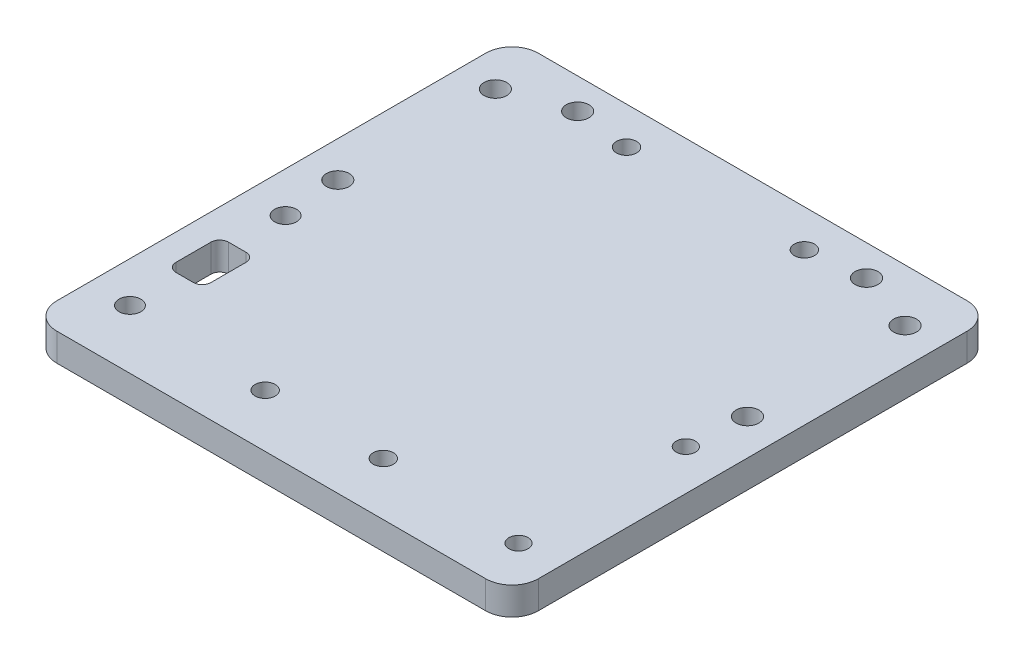
ISO-10303-21;
HEADER;
FILE_DESCRIPTION(('STEP AP214'),'2;1');
FILE_NAME('part.step','',(''),(''),'','','');
FILE_SCHEMA(('AUTOMOTIVE_DESIGN { 1 0 10303 214 1 1 1 1 }'));
ENDSEC;
DATA;
#1=APPLICATION_CONTEXT('core data for automotive mechanical design processes');
#2=APPLICATION_PROTOCOL_DEFINITION('international standard','automotive_design',2000,#1);
#3=PRODUCT_CONTEXT('',#1,'mechanical');
#4=PRODUCT('Part','Part','',(#3));
#5=PRODUCT_RELATED_PRODUCT_CATEGORY('part','',(#4));
#6=PRODUCT_DEFINITION_FORMATION('','',#4);
#7=PRODUCT_DEFINITION_CONTEXT('part definition',#1,'design');
#8=PRODUCT_DEFINITION('design','',#6,#7);
#9=PRODUCT_DEFINITION_SHAPE('','',#8);
#10=(LENGTH_UNIT() NAMED_UNIT(*) SI_UNIT(.MILLI.,.METRE.));
#11=(NAMED_UNIT(*) PLANE_ANGLE_UNIT() SI_UNIT($,.RADIAN.));
#12=(NAMED_UNIT(*) SI_UNIT($,.STERADIAN.) SOLID_ANGLE_UNIT());
#13=UNCERTAINTY_MEASURE_WITH_UNIT(LENGTH_MEASURE(1.E-05),#10,'distance_accuracy_value','');
#14=(GEOMETRIC_REPRESENTATION_CONTEXT(3) GLOBAL_UNCERTAINTY_ASSIGNED_CONTEXT((#13)) GLOBAL_UNIT_ASSIGNED_CONTEXT((#10,
#11,#12)) REPRESENTATION_CONTEXT('',''));
#15=CARTESIAN_POINT('',(0.,0.,0.));
#16=DIRECTION('',(0.,0.,1.));
#17=DIRECTION('',(1.,0.,0.));
#18=AXIS2_PLACEMENT_3D('',#15,#16,#17);
#19=CARTESIAN_POINT('',(27.5,3.175,-27.5));
#20=DIRECTION('',(-1.,0.,0.));
#21=DIRECTION('',(0.,0.,1.));
#22=AXIS2_PLACEMENT_3D('',#19,#20,#21);
#23=PLANE('',#22);
#24=DIRECTION('',(0.,0.,-1.));
#25=VECTOR('',#24,1.);
#26=CARTESIAN_POINT('',(27.5,3.175,-27.5));
#27=LINE('',#26,#25);
#28=CARTESIAN_POINT('',(27.5,3.175,24.5));
#29=VERTEX_POINT('',#28);
#30=CARTESIAN_POINT('',(27.5,3.175,-24.5));
#31=VERTEX_POINT('',#30);
#32=EDGE_CURVE('E283',#29,#31,#27,.T.);
#33=ORIENTED_EDGE('',*,*,#32,.F.);
#34=DIRECTION('',(0.,-1.,0.));
#35=VECTOR('',#34,1.);
#36=CARTESIAN_POINT('',(27.5,3.175,24.5));
#37=LINE('',#36,#35);
#38=CARTESIAN_POINT('',(27.5,0.,24.5));
#39=VERTEX_POINT('',#38);
#40=EDGE_CURVE('E334',#29,#39,#37,.T.);
#41=ORIENTED_EDGE('',*,*,#40,.T.);
#42=DIRECTION('',(0.,0.,-1.));
#43=VECTOR('',#42,1.);
#44=CARTESIAN_POINT('',(27.5,0.,-27.5));
#45=LINE('',#44,#43);
#46=CARTESIAN_POINT('',(27.5,0.,-24.5));
#47=VERTEX_POINT('',#46);
#48=EDGE_CURVE('E282',#39,#47,#45,.T.);
#49=ORIENTED_EDGE('',*,*,#48,.T.);
#50=DIRECTION('',(0.,-1.,0.));
#51=VECTOR('',#50,1.);
#52=CARTESIAN_POINT('',(27.5,3.175,-24.5));
#53=LINE('',#52,#51);
#54=EDGE_CURVE('E332',#47,#31,#53,.F.);
#55=ORIENTED_EDGE('',*,*,#54,.T.);
#56=EDGE_LOOP('',(#33,#41,#49,#55));
#57=FACE_BOUND('',#56,.T.);
#58=ADVANCED_FACE('F33',(#57),#23,.F.);
#59=CARTESIAN_POINT('',(-27.5,3.175,-27.5));
#60=DIRECTION('',(0.,0.,1.));
#61=DIRECTION('',(1.,0.,0.));
#62=AXIS2_PLACEMENT_3D('',#59,#60,#61);
#63=PLANE('',#62);
#64=DIRECTION('',(-1.,0.,0.));
#65=VECTOR('',#64,1.);
#66=CARTESIAN_POINT('',(-27.5,3.175,-27.5));
#67=LINE('',#66,#65);
#68=CARTESIAN_POINT('',(24.5,3.175,-27.5));
#69=VERTEX_POINT('',#68);
#70=CARTESIAN_POINT('',(-24.5,3.175,-27.5));
#71=VERTEX_POINT('',#70);
#72=EDGE_CURVE('E286',#69,#71,#67,.T.);
#73=ORIENTED_EDGE('',*,*,#72,.F.);
#74=DIRECTION('',(0.,-1.,0.));
#75=VECTOR('',#74,1.);
#76=CARTESIAN_POINT('',(24.5,3.175,-27.5));
#77=LINE('',#76,#75);
#78=CARTESIAN_POINT('',(24.5,0.,-27.5));
#79=VERTEX_POINT('',#78);
#80=EDGE_CURVE('E11',#69,#79,#77,.T.);
#81=ORIENTED_EDGE('',*,*,#80,.T.);
#82=DIRECTION('',(-1.,0.,0.));
#83=VECTOR('',#82,1.);
#84=CARTESIAN_POINT('',(-27.5,0.,-27.5));
#85=LINE('',#84,#83);
#86=CARTESIAN_POINT('',(-24.5,0.,-27.5));
#87=VERTEX_POINT('',#86);
#88=EDGE_CURVE('E299',#79,#87,#85,.T.);
#89=ORIENTED_EDGE('',*,*,#88,.T.);
#90=DIRECTION('',(0.,-1.,0.));
#91=VECTOR('',#90,1.);
#92=CARTESIAN_POINT('',(-24.5,3.175,-27.5));
#93=LINE('',#92,#91);
#94=EDGE_CURVE('E41',#87,#71,#93,.F.);
#95=ORIENTED_EDGE('',*,*,#94,.T.);
#96=EDGE_LOOP('',(#73,#81,#89,#95));
#97=FACE_BOUND('',#96,.T.);
#98=ADVANCED_FACE('F339',(#97),#63,.F.);
#99=CARTESIAN_POINT('',(-27.5,3.175,-27.5));
#100=DIRECTION('',(1.,0.,0.));
#101=DIRECTION('',(0.,0.,-1.));
#102=AXIS2_PLACEMENT_3D('',#99,#100,#101);
#103=PLANE('',#102);
#104=DIRECTION('',(0.,0.,1.));
#105=VECTOR('',#104,1.);
#106=CARTESIAN_POINT('',(-27.5,0.,-27.5));
#107=LINE('',#106,#105);
#108=CARTESIAN_POINT('',(-27.5,0.,-24.5));
#109=VERTEX_POINT('',#108);
#110=CARTESIAN_POINT('',(-27.5,0.,24.5));
#111=VERTEX_POINT('',#110);
#112=EDGE_CURVE('E302',#109,#111,#107,.T.);
#113=ORIENTED_EDGE('',*,*,#112,.T.);
#114=DIRECTION('',(0.,-1.,0.));
#115=VECTOR('',#114,1.);
#116=CARTESIAN_POINT('',(-27.5,3.175,24.5));
#117=LINE('',#116,#115);
#118=CARTESIAN_POINT('',(-27.5,3.175,24.5));
#119=VERTEX_POINT('',#118);
#120=EDGE_CURVE('E322',#111,#119,#117,.F.);
#121=ORIENTED_EDGE('',*,*,#120,.T.);
#122=DIRECTION('',(0.,0.,1.));
#123=VECTOR('',#122,1.);
#124=CARTESIAN_POINT('',(-27.5,3.175,-27.5));
#125=LINE('',#124,#123);
#126=CARTESIAN_POINT('',(-27.5,3.175,-24.5));
#127=VERTEX_POINT('',#126);
#128=EDGE_CURVE('E290',#127,#119,#125,.T.);
#129=ORIENTED_EDGE('',*,*,#128,.F.);
#130=DIRECTION('',(0.,-1.,0.));
#131=VECTOR('',#130,1.);
#132=CARTESIAN_POINT('',(-27.5,3.175,-24.5));
#133=LINE('',#132,#131);
#134=EDGE_CURVE('E319',#127,#109,#133,.T.);
#135=ORIENTED_EDGE('',*,*,#134,.T.);
#136=EDGE_LOOP('',(#113,#121,#129,#135));
#137=FACE_BOUND('',#136,.T.);
#138=ADVANCED_FACE('F350',(#137),#103,.F.);
#139=CARTESIAN_POINT('',(-27.5,3.175,27.5));
#140=DIRECTION('',(0.,0.,-1.));
#141=DIRECTION('',(-1.,0.,0.));
#142=AXIS2_PLACEMENT_3D('',#139,#140,#141);
#143=PLANE('',#142);
#144=DIRECTION('',(1.,0.,0.));
#145=VECTOR('',#144,1.);
#146=CARTESIAN_POINT('',(-27.5,3.175,27.5));
#147=LINE('',#146,#145);
#148=CARTESIAN_POINT('',(-24.5,3.175,27.5));
#149=VERTEX_POINT('',#148);
#150=CARTESIAN_POINT('',(24.5,3.175,27.5));
#151=VERTEX_POINT('',#150);
#152=EDGE_CURVE('E293',#149,#151,#147,.T.);
#153=ORIENTED_EDGE('',*,*,#152,.F.);
#154=DIRECTION('',(0.,-1.,0.));
#155=VECTOR('',#154,1.);
#156=CARTESIAN_POINT('',(-24.5,3.175,27.5));
#157=LINE('',#156,#155);
#158=CARTESIAN_POINT('',(-24.5,0.,27.5));
#159=VERTEX_POINT('',#158);
#160=EDGE_CURVE('E308',#149,#159,#157,.T.);
#161=ORIENTED_EDGE('',*,*,#160,.T.);
#162=DIRECTION('',(1.,0.,0.));
#163=VECTOR('',#162,1.);
#164=CARTESIAN_POINT('',(-27.5,0.,27.5));
#165=LINE('',#164,#163);
#166=CARTESIAN_POINT('',(24.5,0.,27.5));
#167=VERTEX_POINT('',#166);
#168=EDGE_CURVE('E287',#159,#167,#165,.T.);
#169=ORIENTED_EDGE('',*,*,#168,.T.);
#170=DIRECTION('',(0.,-1.,0.));
#171=VECTOR('',#170,1.);
#172=CARTESIAN_POINT('',(24.5,3.175,27.5));
#173=LINE('',#172,#171);
#174=EDGE_CURVE('E296',#167,#151,#173,.F.);
#175=ORIENTED_EDGE('',*,*,#174,.T.);
#176=EDGE_LOOP('',(#153,#161,#169,#175));
#177=FACE_BOUND('',#176,.T.);
#178=ADVANCED_FACE('F361',(#177),#143,.F.);
#179=CARTESIAN_POINT('',(0.,3.175,0.));
#180=DIRECTION('',(0.,1.,0.));
#181=DIRECTION('',(0.,0.,1.));
#182=AXIS2_PLACEMENT_3D('',#179,#180,#181);
#183=PLANE('',#182);
#184=CARTESIAN_POINT('',(-23.5,3.175,13.89));
#185=DIRECTION('',(0.,1.,0.));
#186=DIRECTION('',(0.,0.,1.));
#187=AXIS2_PLACEMENT_3D('',#184,#185,#186);
#188=CIRCLE('',#187,1.);
#189=CARTESIAN_POINT('',(-24.5,3.175,13.89));
#190=VERTEX_POINT('',#189);
#191=CARTESIAN_POINT('',(-23.5,3.175,14.89));
#192=VERTEX_POINT('',#191);
#193=EDGE_CURVE('E48',#190,#192,#188,.T.);
#194=ORIENTED_EDGE('',*,*,#193,.F.);
#195=DIRECTION('',(0.,0.,1.));
#196=VECTOR('',#195,1.);
#197=CARTESIAN_POINT('',(-24.5,3.175,9.89000000000001));
#198=LINE('',#197,#196);
#199=CARTESIAN_POINT('',(-24.5,3.175,9.89000000000001));
#200=VERTEX_POINT('',#199);
#201=EDGE_CURVE('E180',#200,#190,#198,.T.);
#202=ORIENTED_EDGE('',*,*,#201,.F.);
#203=CARTESIAN_POINT('',(-23.5,3.175,9.89));
#204=DIRECTION('',(0.,1.,0.));
#205=DIRECTION('',(0.,0.,1.));
#206=AXIS2_PLACEMENT_3D('',#203,#204,#205);
#207=CIRCLE('',#206,1.);
#208=CARTESIAN_POINT('',(-23.5,3.175,8.89));
#209=VERTEX_POINT('',#208);
#210=EDGE_CURVE('E177',#209,#200,#207,.T.);
#211=ORIENTED_EDGE('',*,*,#210,.F.);
#212=DIRECTION('',(-1.,0.,0.));
#213=VECTOR('',#212,1.);
#214=CARTESIAN_POINT('',(-23.5,3.175,8.89));
#215=LINE('',#214,#213);
#216=CARTESIAN_POINT('',(-21.5,3.175,8.89));
#217=VERTEX_POINT('',#216);
#218=EDGE_CURVE('E174',#217,#209,#215,.T.);
#219=ORIENTED_EDGE('',*,*,#218,.F.);
#220=CARTESIAN_POINT('',(-21.5,3.175,9.89));
#221=DIRECTION('',(0.,1.,0.));
#222=DIRECTION('',(0.,0.,-1.));
#223=AXIS2_PLACEMENT_3D('',#220,#221,#222);
#224=CIRCLE('',#223,1.);
#225=CARTESIAN_POINT('',(-20.5,3.175,9.89000000000001));
#226=VERTEX_POINT('',#225);
#227=EDGE_CURVE('E168',#226,#217,#224,.T.);
#228=ORIENTED_EDGE('',*,*,#227,.F.);
#229=DIRECTION('',(0.,0.,-1.));
#230=VECTOR('',#229,1.);
#231=CARTESIAN_POINT('',(-20.5,3.175,9.89000000000001));
#232=LINE('',#231,#230);
#233=CARTESIAN_POINT('',(-20.5,3.175,13.89));
#234=VERTEX_POINT('',#233);
#235=EDGE_CURVE('E166',#234,#226,#232,.T.);
#236=ORIENTED_EDGE('',*,*,#235,.F.);
#237=CARTESIAN_POINT('',(-21.5,3.175,13.89));
#238=DIRECTION('',(0.,1.,0.));
#239=DIRECTION('',(0.,0.,1.));
#240=AXIS2_PLACEMENT_3D('',#237,#238,#239);
#241=CIRCLE('',#240,1.);
#242=CARTESIAN_POINT('',(-21.5,3.175,14.89));
#243=VERTEX_POINT('',#242);
#244=EDGE_CURVE('E149',#243,#234,#241,.T.);
#245=ORIENTED_EDGE('',*,*,#244,.F.);
#246=DIRECTION('',(1.,0.,0.));
#247=VECTOR('',#246,1.);
#248=CARTESIAN_POINT('',(-23.5,3.175,14.89));
#249=LINE('',#248,#247);
#250=EDGE_CURVE('E158',#192,#243,#249,.T.);
#251=ORIENTED_EDGE('',*,*,#250,.F.);
#252=EDGE_LOOP('',(#194,#202,#211,#219,#228,#236,#245,#251));
#253=FACE_BOUND('',#252,.T.);
#254=CARTESIAN_POINT('',(-16.5,3.175,-24.));
#255=DIRECTION('',(0.,1.,0.));
#256=DIRECTION('',(0.,0.,1.));
#257=AXIS2_PLACEMENT_3D('',#254,#255,#256);
#258=CIRCLE('',#257,1.3);
#259=CARTESIAN_POINT('',(-16.5,3.175,-22.7));
#260=VERTEX_POINT('',#259);
#261=EDGE_CURVE('E199',#260,#260,#258,.T.);
#262=ORIENTED_EDGE('',*,*,#261,.F.);
#263=EDGE_LOOP('',(#262));
#264=FACE_BOUND('',#263,.T.);
#265=CARTESIAN_POINT('',(16.5,3.175,-24.));
#266=DIRECTION('',(0.,1.,0.));
#267=DIRECTION('',(0.,0.,-1.));
#268=AXIS2_PLACEMENT_3D('',#265,#266,#267);
#269=CIRCLE('',#268,1.3);
#270=CARTESIAN_POINT('',(16.5,3.175,-25.3));
#271=VERTEX_POINT('',#270);
#272=EDGE_CURVE('E197',#271,#271,#269,.T.);
#273=ORIENTED_EDGE('',*,*,#272,.F.);
#274=EDGE_LOOP('',(#273));
#275=FACE_BOUND('',#274,.T.);
#276=CARTESIAN_POINT('',(-6.74999999999999,3.175,21.45));
#277=DIRECTION('',(0.,1.,0.));
#278=DIRECTION('',(0.,0.,1.));
#279=AXIS2_PLACEMENT_3D('',#276,#277,#278);
#280=CIRCLE('',#279,1.15);
#281=CARTESIAN_POINT('',(-6.74999999999999,3.175,22.6));
#282=VERTEX_POINT('',#281);
#283=EDGE_CURVE('E211',#282,#282,#280,.T.);
#284=ORIENTED_EDGE('',*,*,#283,.F.);
#285=EDGE_LOOP('',(#284));
#286=FACE_BOUND('',#285,.T.);
#287=CARTESIAN_POINT('',(6.75,3.175,21.45));
#288=DIRECTION('',(0.,1.,0.));
#289=DIRECTION('',(0.,0.,-1.));
#290=AXIS2_PLACEMENT_3D('',#287,#288,#289);
#291=CIRCLE('',#290,1.15);
#292=CARTESIAN_POINT('',(6.75,3.175,20.3));
#293=VERTEX_POINT('',#292);
#294=EDGE_CURVE('E206',#293,#293,#291,.T.);
#295=ORIENTED_EDGE('',*,*,#294,.F.);
#296=EDGE_LOOP('',(#295));
#297=FACE_BOUND('',#296,.T.);
#298=CARTESIAN_POINT('',(-10.16,3.175,-23.24));
#299=DIRECTION('',(0.,1.,0.));
#300=DIRECTION('',(0.,0.,1.));
#301=AXIS2_PLACEMENT_3D('',#298,#299,#300);
#302=CIRCLE('',#301,1.15);
#303=CARTESIAN_POINT('',(-10.16,3.175,-22.09));
#304=VERTEX_POINT('',#303);
#305=EDGE_CURVE('E223',#304,#304,#302,.T.);
#306=ORIENTED_EDGE('',*,*,#305,.F.);
#307=EDGE_LOOP('',(#306));
#308=FACE_BOUND('',#307,.T.);
#309=CARTESIAN_POINT('',(10.16,3.175,-23.24));
#310=DIRECTION('',(0.,1.,0.));
#311=DIRECTION('',(0.,0.,1.));
#312=AXIS2_PLACEMENT_3D('',#309,#310,#311);
#313=CIRCLE('',#312,1.15);
#314=CARTESIAN_POINT('',(10.16,3.175,-22.09));
#315=VERTEX_POINT('',#314);
#316=EDGE_CURVE('E218',#315,#315,#313,.T.);
#317=ORIENTED_EDGE('',*,*,#316,.F.);
#318=EDGE_LOOP('',(#317));
#319=FACE_BOUND('',#318,.T.);
#320=CARTESIAN_POINT('',(-22.865,3.175,20.78));
#321=DIRECTION('',(0.,1.,0.));
#322=DIRECTION('',(0.,0.,1.));
#323=AXIS2_PLACEMENT_3D('',#320,#321,#322);
#324=CIRCLE('',#323,1.25);
#325=CARTESIAN_POINT('',(-22.865,3.175,22.03));
#326=VERTEX_POINT('',#325);
#327=EDGE_CURVE('E230',#326,#326,#324,.T.);
#328=ORIENTED_EDGE('',*,*,#327,.F.);
#329=EDGE_LOOP('',(#328));
#330=FACE_BOUND('',#329,.T.);
#331=CARTESIAN_POINT('',(22.855,3.175,22.11));
#332=DIRECTION('',(0.,1.,0.));
#333=DIRECTION('',(0.,0.,1.));
#334=AXIS2_PLACEMENT_3D('',#331,#332,#333);
#335=CIRCLE('',#334,1.1);
#336=CARTESIAN_POINT('',(22.855,3.175,23.21));
#337=VERTEX_POINT('',#336);
#338=EDGE_CURVE('E243',#337,#337,#335,.T.);
#339=ORIENTED_EDGE('',*,*,#338,.F.);
#340=EDGE_LOOP('',(#339));
#341=FACE_BOUND('',#340,.T.);
#342=CARTESIAN_POINT('',(22.855,3.175,3.));
#343=DIRECTION('',(0.,1.,0.));
#344=DIRECTION('',(0.,0.,1.));
#345=AXIS2_PLACEMENT_3D('',#342,#343,#344);
#346=CIRCLE('',#345,1.1);
#347=CARTESIAN_POINT('',(22.855,3.175,4.1));
#348=VERTEX_POINT('',#347);
#349=EDGE_CURVE('E235',#348,#348,#346,.T.);
#350=ORIENTED_EDGE('',*,*,#349,.F.);
#351=EDGE_LOOP('',(#350));
#352=FACE_BOUND('',#351,.T.);
#353=CARTESIAN_POINT('',(-22.865,3.175,3.));
#354=DIRECTION('',(0.,1.,0.));
#355=DIRECTION('',(0.,0.,1.));
#356=AXIS2_PLACEMENT_3D('',#353,#354,#355);
#357=CIRCLE('',#356,1.25);
#358=CARTESIAN_POINT('',(-22.865,3.175,4.25));
#359=VERTEX_POINT('',#358);
#360=EDGE_CURVE('E242',#359,#359,#357,.T.);
#361=ORIENTED_EDGE('',*,*,#360,.F.);
#362=EDGE_LOOP('',(#361));
#363=FACE_BOUND('',#362,.T.);
#364=CARTESIAN_POINT('',(23.4,3.175,-21.5));
#365=DIRECTION('',(0.,1.,0.));
#366=DIRECTION('',(0.,0.,-1.));
#367=AXIS2_PLACEMENT_3D('',#364,#365,#366);
#368=CIRCLE('',#367,1.29999999999999);
#369=CARTESIAN_POINT('',(23.4,3.175,-22.8));
#370=VERTEX_POINT('',#369);
#371=EDGE_CURVE('E258',#370,#370,#368,.T.);
#372=ORIENTED_EDGE('',*,*,#371,.F.);
#373=EDGE_LOOP('',(#372));
#374=FACE_BOUND('',#373,.T.);
#375=CARTESIAN_POINT('',(23.4,3.175,-3.5));
#376=DIRECTION('',(0.,1.,0.));
#377=DIRECTION('',(0.,0.,-1.));
#378=AXIS2_PLACEMENT_3D('',#375,#376,#377);
#379=CIRCLE('',#378,1.29999999999999);
#380=CARTESIAN_POINT('',(23.4,3.175,-4.8));
#381=VERTEX_POINT('',#380);
#382=EDGE_CURVE('E267',#381,#381,#379,.T.);
#383=ORIENTED_EDGE('',*,*,#382,.F.);
#384=EDGE_LOOP('',(#383));
#385=FACE_BOUND('',#384,.T.);
#386=CARTESIAN_POINT('',(-23.4,3.175,-3.5));
#387=DIRECTION('',(0.,1.,0.));
#388=DIRECTION('',(0.,0.,1.));
#389=AXIS2_PLACEMENT_3D('',#386,#387,#388);
#390=CIRCLE('',#389,1.29999999999999);
#391=CARTESIAN_POINT('',(-23.4,3.175,-2.2));
#392=VERTEX_POINT('',#391);
#393=EDGE_CURVE('E259',#392,#392,#390,.T.);
#394=ORIENTED_EDGE('',*,*,#393,.F.);
#395=EDGE_LOOP('',(#394));
#396=FACE_BOUND('',#395,.T.);
#397=CARTESIAN_POINT('',(-23.4,3.175,-21.5));
#398=DIRECTION('',(0.,1.,0.));
#399=DIRECTION('',(0.,0.,1.));
#400=AXIS2_PLACEMENT_3D('',#397,#398,#399);
#401=CIRCLE('',#400,1.29999999999999);
#402=CARTESIAN_POINT('',(-23.4,3.175,-20.2));
#403=VERTEX_POINT('',#402);
#404=EDGE_CURVE('E266',#403,#403,#401,.T.);
#405=ORIENTED_EDGE('',*,*,#404,.F.);
#406=EDGE_LOOP('',(#405));
#407=FACE_BOUND('',#406,.T.);
#408=ORIENTED_EDGE('',*,*,#128,.T.);
#409=CARTESIAN_POINT('',(-24.5,3.175,24.5));
#410=DIRECTION('',(0.,1.,0.));
#411=DIRECTION('',(0.,0.,1.));
#412=AXIS2_PLACEMENT_3D('',#409,#410,#411);
#413=CIRCLE('',#412,3.);
#414=EDGE_CURVE('E330',#119,#149,#413,.T.);
#415=ORIENTED_EDGE('',*,*,#414,.T.);
#416=ORIENTED_EDGE('',*,*,#152,.T.);
#417=CARTESIAN_POINT('',(24.5,3.175,24.5));
#418=DIRECTION('',(0.,1.,0.));
#419=DIRECTION('',(0.,0.,1.));
#420=AXIS2_PLACEMENT_3D('',#417,#418,#419);
#421=CIRCLE('',#420,3.);
#422=EDGE_CURVE('E328',#151,#29,#421,.T.);
#423=ORIENTED_EDGE('',*,*,#422,.T.);
#424=ORIENTED_EDGE('',*,*,#32,.T.);
#425=CARTESIAN_POINT('',(24.5,3.175,-24.5));
#426=DIRECTION('',(0.,1.,0.));
#427=DIRECTION('',(0.,0.,1.));
#428=AXIS2_PLACEMENT_3D('',#425,#426,#427);
#429=CIRCLE('',#428,3.);
#430=EDGE_CURVE('E326',#31,#69,#429,.T.);
#431=ORIENTED_EDGE('',*,*,#430,.T.);
#432=ORIENTED_EDGE('',*,*,#72,.T.);
#433=CARTESIAN_POINT('',(-24.5,3.175,-24.5));
#434=DIRECTION('',(0.,1.,0.));
#435=DIRECTION('',(0.,0.,1.));
#436=AXIS2_PLACEMENT_3D('',#433,#434,#435);
#437=CIRCLE('',#436,3.);
#438=EDGE_CURVE('E324',#71,#127,#437,.T.);
#439=ORIENTED_EDGE('',*,*,#438,.T.);
#440=EDGE_LOOP('',(#408,#415,#416,#423,#424,#431,#432,#439));
#441=FACE_BOUND('',#440,.T.);
#442=ADVANCED_FACE('F162',(#253,#264,#275,#286,#297,#308,#319,#330,#341,#352,#363,#374,#385,
#396,#407,#441),#183,.T.);
#443=CARTESIAN_POINT('',(0.,0.,0.));
#444=DIRECTION('',(0.,1.,0.));
#445=DIRECTION('',(0.,0.,1.));
#446=AXIS2_PLACEMENT_3D('',#443,#444,#445);
#447=PLANE('',#446);
#448=DIRECTION('',(0.,0.,-1.));
#449=VECTOR('',#448,1.);
#450=CARTESIAN_POINT('',(-24.5,0.,9.89000000000001));
#451=LINE('',#450,#449);
#452=CARTESIAN_POINT('',(-24.5,0.,13.89));
#453=VERTEX_POINT('',#452);
#454=CARTESIAN_POINT('',(-24.5,0.,9.89000000000001));
#455=VERTEX_POINT('',#454);
#456=EDGE_CURVE('E679',#453,#455,#451,.T.);
#457=ORIENTED_EDGE('',*,*,#456,.F.);
#458=CARTESIAN_POINT('',(-23.5,0.,13.89));
#459=DIRECTION('',(0.,1.,0.));
#460=DIRECTION('',(0.,0.,1.));
#461=AXIS2_PLACEMENT_3D('',#458,#459,#460);
#462=CIRCLE('',#461,1.);
#463=CARTESIAN_POINT('',(-23.5,0.,14.89));
#464=VERTEX_POINT('',#463);
#465=EDGE_CURVE('E198',#464,#453,#462,.F.);
#466=ORIENTED_EDGE('',*,*,#465,.F.);
#467=DIRECTION('',(-1.,0.,0.));
#468=VECTOR('',#467,1.);
#469=CARTESIAN_POINT('',(-23.5,0.,14.89));
#470=LINE('',#469,#468);
#471=CARTESIAN_POINT('',(-21.5,0.,14.89));
#472=VERTEX_POINT('',#471);
#473=EDGE_CURVE('E195',#472,#464,#470,.T.);
#474=ORIENTED_EDGE('',*,*,#473,.F.);
#475=CARTESIAN_POINT('',(-21.5,0.,13.89));
#476=DIRECTION('',(0.,1.,0.));
#477=DIRECTION('',(0.,0.,1.));
#478=AXIS2_PLACEMENT_3D('',#475,#476,#477);
#479=CIRCLE('',#478,1.);
#480=CARTESIAN_POINT('',(-20.5,0.,13.89));
#481=VERTEX_POINT('',#480);
#482=EDGE_CURVE('E152',#481,#472,#479,.F.);
#483=ORIENTED_EDGE('',*,*,#482,.F.);
#484=DIRECTION('',(0.,0.,1.));
#485=VECTOR('',#484,1.);
#486=CARTESIAN_POINT('',(-20.5,0.,9.89000000000001));
#487=LINE('',#486,#485);
#488=CARTESIAN_POINT('',(-20.5,0.,9.89000000000001));
#489=VERTEX_POINT('',#488);
#490=EDGE_CURVE('E665',#489,#481,#487,.T.);
#491=ORIENTED_EDGE('',*,*,#490,.F.);
#492=CARTESIAN_POINT('',(-21.5,0.,9.89));
#493=DIRECTION('',(0.,1.,0.));
#494=DIRECTION('',(0.,0.,1.));
#495=AXIS2_PLACEMENT_3D('',#492,#493,#494);
#496=CIRCLE('',#495,1.);
#497=CARTESIAN_POINT('',(-21.5,0.,8.89));
#498=VERTEX_POINT('',#497);
#499=EDGE_CURVE('E667',#498,#489,#496,.F.);
#500=ORIENTED_EDGE('',*,*,#499,.F.);
#501=DIRECTION('',(1.,0.,0.));
#502=VECTOR('',#501,1.);
#503=CARTESIAN_POINT('',(-23.5,0.,8.89));
#504=LINE('',#503,#502);
#505=CARTESIAN_POINT('',(-23.5,0.,8.89));
#506=VERTEX_POINT('',#505);
#507=EDGE_CURVE('E675',#506,#498,#504,.T.);
#508=ORIENTED_EDGE('',*,*,#507,.F.);
#509=CARTESIAN_POINT('',(-23.5,0.,9.89));
#510=DIRECTION('',(0.,1.,0.));
#511=DIRECTION('',(0.,0.,1.));
#512=AXIS2_PLACEMENT_3D('',#509,#510,#511);
#513=CIRCLE('',#512,1.);
#514=EDGE_CURVE('E677',#455,#506,#513,.F.);
#515=ORIENTED_EDGE('',*,*,#514,.F.);
#516=EDGE_LOOP('',(#457,#466,#474,#483,#491,#500,#508,#515));
#517=FACE_BOUND('',#516,.T.);
#518=CARTESIAN_POINT('',(-16.5,0.,-24.));
#519=DIRECTION('',(0.,1.,0.));
#520=DIRECTION('',(0.,0.,1.));
#521=AXIS2_PLACEMENT_3D('',#518,#519,#520);
#522=CIRCLE('',#521,1.3);
#523=CARTESIAN_POINT('',(-16.5,0.,-22.7));
#524=VERTEX_POINT('',#523);
#525=EDGE_CURVE('E202',#524,#524,#522,.F.);
#526=ORIENTED_EDGE('',*,*,#525,.F.);
#527=EDGE_LOOP('',(#526));
#528=FACE_BOUND('',#527,.T.);
#529=CARTESIAN_POINT('',(16.5,0.,-24.));
#530=DIRECTION('',(0.,1.,0.));
#531=DIRECTION('',(0.,0.,1.));
#532=AXIS2_PLACEMENT_3D('',#529,#530,#531);
#533=CIRCLE('',#532,1.3);
#534=CARTESIAN_POINT('',(16.5,0.,-22.7));
#535=VERTEX_POINT('',#534);
#536=EDGE_CURVE('E203',#535,#535,#533,.F.);
#537=ORIENTED_EDGE('',*,*,#536,.F.);
#538=EDGE_LOOP('',(#537));
#539=FACE_BOUND('',#538,.T.);
#540=CARTESIAN_POINT('',(-6.74999999999999,0.,21.45));
#541=DIRECTION('',(0.,1.,0.));
#542=DIRECTION('',(0.,0.,1.));
#543=AXIS2_PLACEMENT_3D('',#540,#541,#542);
#544=CIRCLE('',#543,1.15);
#545=CARTESIAN_POINT('',(-6.74999999999999,0.,22.6));
#546=VERTEX_POINT('',#545);
#547=EDGE_CURVE('E214',#546,#546,#544,.F.);
#548=ORIENTED_EDGE('',*,*,#547,.F.);
#549=EDGE_LOOP('',(#548));
#550=FACE_BOUND('',#549,.T.);
#551=CARTESIAN_POINT('',(6.75,0.,21.45));
#552=DIRECTION('',(0.,1.,0.));
#553=DIRECTION('',(0.,0.,1.));
#554=AXIS2_PLACEMENT_3D('',#551,#552,#553);
#555=CIRCLE('',#554,1.15);
#556=CARTESIAN_POINT('',(6.75,0.,22.6));
#557=VERTEX_POINT('',#556);
#558=EDGE_CURVE('E215',#557,#557,#555,.F.);
#559=ORIENTED_EDGE('',*,*,#558,.F.);
#560=EDGE_LOOP('',(#559));
#561=FACE_BOUND('',#560,.T.);
#562=CARTESIAN_POINT('',(-10.16,0.,-23.24));
#563=DIRECTION('',(0.,1.,0.));
#564=DIRECTION('',(0.,0.,1.));
#565=AXIS2_PLACEMENT_3D('',#562,#563,#564);
#566=CIRCLE('',#565,1.15);
#567=CARTESIAN_POINT('',(-10.16,0.,-22.09));
#568=VERTEX_POINT('',#567);
#569=EDGE_CURVE('E226',#568,#568,#566,.F.);
#570=ORIENTED_EDGE('',*,*,#569,.F.);
#571=EDGE_LOOP('',(#570));
#572=FACE_BOUND('',#571,.T.);
#573=CARTESIAN_POINT('',(10.16,0.,-23.24));
#574=DIRECTION('',(0.,1.,0.));
#575=DIRECTION('',(0.,0.,1.));
#576=AXIS2_PLACEMENT_3D('',#573,#574,#575);
#577=CIRCLE('',#576,1.15);
#578=CARTESIAN_POINT('',(10.16,0.,-22.09));
#579=VERTEX_POINT('',#578);
#580=EDGE_CURVE('E227',#579,#579,#577,.F.);
#581=ORIENTED_EDGE('',*,*,#580,.F.);
#582=EDGE_LOOP('',(#581));
#583=FACE_BOUND('',#582,.T.);
#584=CARTESIAN_POINT('',(-22.865,0.,20.78));
#585=DIRECTION('',(0.,1.,0.));
#586=DIRECTION('',(0.,0.,1.));
#587=AXIS2_PLACEMENT_3D('',#584,#585,#586);
#588=CIRCLE('',#587,1.25);
#589=CARTESIAN_POINT('',(-22.865,0.,22.03));
#590=VERTEX_POINT('',#589);
#591=EDGE_CURVE('E246',#590,#590,#588,.F.);
#592=ORIENTED_EDGE('',*,*,#591,.F.);
#593=EDGE_LOOP('',(#592));
#594=FACE_BOUND('',#593,.T.);
#595=CARTESIAN_POINT('',(22.855,0.,22.11));
#596=DIRECTION('',(0.,1.,0.));
#597=DIRECTION('',(0.,0.,1.));
#598=AXIS2_PLACEMENT_3D('',#595,#596,#597);
#599=CIRCLE('',#598,1.1);
#600=CARTESIAN_POINT('',(22.855,0.,23.21));
#601=VERTEX_POINT('',#600);
#602=EDGE_CURVE('E239',#601,#601,#599,.F.);
#603=ORIENTED_EDGE('',*,*,#602,.F.);
#604=EDGE_LOOP('',(#603));
#605=FACE_BOUND('',#604,.T.);
#606=CARTESIAN_POINT('',(22.855,0.,3.));
#607=DIRECTION('',(0.,1.,0.));
#608=DIRECTION('',(0.,0.,1.));
#609=AXIS2_PLACEMENT_3D('',#606,#607,#608);
#610=CIRCLE('',#609,1.1);
#611=CARTESIAN_POINT('',(22.855,0.,4.1));
#612=VERTEX_POINT('',#611);
#613=EDGE_CURVE('E238',#612,#612,#610,.F.);
#614=ORIENTED_EDGE('',*,*,#613,.F.);
#615=EDGE_LOOP('',(#614));
#616=FACE_BOUND('',#615,.T.);
#617=CARTESIAN_POINT('',(-22.865,0.,3.));
#618=DIRECTION('',(0.,1.,0.));
#619=DIRECTION('',(0.,0.,1.));
#620=AXIS2_PLACEMENT_3D('',#617,#618,#619);
#621=CIRCLE('',#620,1.25);
#622=CARTESIAN_POINT('',(-22.865,0.,4.25));
#623=VERTEX_POINT('',#622);
#624=EDGE_CURVE('E255',#623,#623,#621,.F.);
#625=ORIENTED_EDGE('',*,*,#624,.F.);
#626=EDGE_LOOP('',(#625));
#627=FACE_BOUND('',#626,.T.);
#628=CARTESIAN_POINT('',(23.4,0.,-21.5));
#629=DIRECTION('',(0.,1.,0.));
#630=DIRECTION('',(0.,0.,1.));
#631=AXIS2_PLACEMENT_3D('',#628,#629,#630);
#632=CIRCLE('',#631,1.29999999999999);
#633=CARTESIAN_POINT('',(23.4,0.,-20.2));
#634=VERTEX_POINT('',#633);
#635=EDGE_CURVE('E270',#634,#634,#632,.F.);
#636=ORIENTED_EDGE('',*,*,#635,.F.);
#637=EDGE_LOOP('',(#636));
#638=FACE_BOUND('',#637,.T.);
#639=CARTESIAN_POINT('',(23.4,0.,-3.5));
#640=DIRECTION('',(0.,1.,0.));
#641=DIRECTION('',(0.,0.,1.));
#642=AXIS2_PLACEMENT_3D('',#639,#640,#641);
#643=CIRCLE('',#642,1.29999999999999);
#644=CARTESIAN_POINT('',(23.4,0.,-2.20000000000001));
#645=VERTEX_POINT('',#644);
#646=EDGE_CURVE('E263',#645,#645,#643,.F.);
#647=ORIENTED_EDGE('',*,*,#646,.F.);
#648=EDGE_LOOP('',(#647));
#649=FACE_BOUND('',#648,.T.);
#650=CARTESIAN_POINT('',(-23.4,0.,-3.5));
#651=DIRECTION('',(0.,1.,0.));
#652=DIRECTION('',(0.,0.,1.));
#653=AXIS2_PLACEMENT_3D('',#650,#651,#652);
#654=CIRCLE('',#653,1.29999999999999);
#655=CARTESIAN_POINT('',(-23.4,0.,-2.2));
#656=VERTEX_POINT('',#655);
#657=EDGE_CURVE('E262',#656,#656,#654,.F.);
#658=ORIENTED_EDGE('',*,*,#657,.F.);
#659=EDGE_LOOP('',(#658));
#660=FACE_BOUND('',#659,.T.);
#661=CARTESIAN_POINT('',(-23.4,0.,-21.5));
#662=DIRECTION('',(0.,1.,0.));
#663=DIRECTION('',(0.,0.,1.));
#664=AXIS2_PLACEMENT_3D('',#661,#662,#663);
#665=CIRCLE('',#664,1.29999999999999);
#666=CARTESIAN_POINT('',(-23.4,0.,-20.2));
#667=VERTEX_POINT('',#666);
#668=EDGE_CURVE('E279',#667,#667,#665,.F.);
#669=ORIENTED_EDGE('',*,*,#668,.F.);
#670=EDGE_LOOP('',(#669));
#671=FACE_BOUND('',#670,.T.);
#672=ORIENTED_EDGE('',*,*,#168,.F.);
#673=CARTESIAN_POINT('',(-24.5,0.,24.5));
#674=DIRECTION('',(0.,1.,0.));
#675=DIRECTION('',(0.,0.,1.));
#676=AXIS2_PLACEMENT_3D('',#673,#674,#675);
#677=CIRCLE('',#676,3.);
#678=EDGE_CURVE('E317',#159,#111,#677,.F.);
#679=ORIENTED_EDGE('',*,*,#678,.T.);
#680=ORIENTED_EDGE('',*,*,#112,.F.);
#681=CARTESIAN_POINT('',(-24.5,0.,-24.5));
#682=DIRECTION('',(0.,1.,0.));
#683=DIRECTION('',(0.,0.,1.));
#684=AXIS2_PLACEMENT_3D('',#681,#682,#683);
#685=CIRCLE('',#684,3.);
#686=EDGE_CURVE('E311',#109,#87,#685,.F.);
#687=ORIENTED_EDGE('',*,*,#686,.T.);
#688=ORIENTED_EDGE('',*,*,#88,.F.);
#689=CARTESIAN_POINT('',(24.5,0.,-24.5));
#690=DIRECTION('',(0.,1.,0.));
#691=DIRECTION('',(0.,0.,1.));
#692=AXIS2_PLACEMENT_3D('',#689,#690,#691);
#693=CIRCLE('',#692,3.);
#694=EDGE_CURVE('E313',#79,#47,#693,.F.);
#695=ORIENTED_EDGE('',*,*,#694,.T.);
#696=ORIENTED_EDGE('',*,*,#48,.F.);
#697=CARTESIAN_POINT('',(24.5,0.,24.5));
#698=DIRECTION('',(0.,1.,0.));
#699=DIRECTION('',(0.,0.,1.));
#700=AXIS2_PLACEMENT_3D('',#697,#698,#699);
#701=CIRCLE('',#700,3.);
#702=EDGE_CURVE('E315',#39,#167,#701,.F.);
#703=ORIENTED_EDGE('',*,*,#702,.T.);
#704=EDGE_LOOP('',(#672,#679,#680,#687,#688,#695,#696,#703));
#705=FACE_BOUND('',#704,.T.);
#706=ADVANCED_FACE('F354',(#517,#528,#539,#550,#561,#572,#583,#594,#605,#616,#627,#638,#649,
#660,#671,#705),#447,.F.);
#707=CARTESIAN_POINT('',(-23.4,-3.67695526217003,-21.5));
#708=DIRECTION('',(0.,1.,0.));
#709=DIRECTION('',(0.,0.,1.));
#710=AXIS2_PLACEMENT_3D('',#707,#708,#709);
#711=CYLINDRICAL_SURFACE('',#710,1.29999999999999);
#712=ORIENTED_EDGE('',*,*,#668,.T.);
#713=EDGE_LOOP('',(#712));
#714=FACE_BOUND('',#713,.T.);
#715=ORIENTED_EDGE('',*,*,#404,.T.);
#716=EDGE_LOOP('',(#715));
#717=FACE_BOUND('',#716,.T.);
#718=ADVANCED_FACE('F405',(#714,#717),#711,.F.);
#719=CARTESIAN_POINT('',(-23.4,-3.67695526217003,-3.5));
#720=DIRECTION('',(0.,1.,0.));
#721=DIRECTION('',(0.,0.,1.));
#722=AXIS2_PLACEMENT_3D('',#719,#720,#721);
#723=CYLINDRICAL_SURFACE('',#722,1.29999999999999);
#724=ORIENTED_EDGE('',*,*,#657,.T.);
#725=EDGE_LOOP('',(#724));
#726=FACE_BOUND('',#725,.T.);
#727=ORIENTED_EDGE('',*,*,#393,.T.);
#728=EDGE_LOOP('',(#727));
#729=FACE_BOUND('',#728,.T.);
#730=ADVANCED_FACE('F399',(#726,#729),#723,.F.);
#731=CARTESIAN_POINT('',(23.4,-3.67695526217003,-3.5));
#732=DIRECTION('',(0.,1.,0.));
#733=DIRECTION('',(0.,0.,1.));
#734=AXIS2_PLACEMENT_3D('',#731,#732,#733);
#735=CYLINDRICAL_SURFACE('',#734,1.29999999999999);
#736=ORIENTED_EDGE('',*,*,#646,.T.);
#737=EDGE_LOOP('',(#736));
#738=FACE_BOUND('',#737,.T.);
#739=ORIENTED_EDGE('',*,*,#382,.T.);
#740=EDGE_LOOP('',(#739));
#741=FACE_BOUND('',#740,.T.);
#742=ADVANCED_FACE('F393',(#738,#741),#735,.F.);
#743=CARTESIAN_POINT('',(23.4,-3.67695526217003,-21.5));
#744=DIRECTION('',(0.,1.,0.));
#745=DIRECTION('',(0.,0.,1.));
#746=AXIS2_PLACEMENT_3D('',#743,#744,#745);
#747=CYLINDRICAL_SURFACE('',#746,1.29999999999999);
#748=ORIENTED_EDGE('',*,*,#635,.T.);
#749=EDGE_LOOP('',(#748));
#750=FACE_BOUND('',#749,.T.);
#751=ORIENTED_EDGE('',*,*,#371,.T.);
#752=EDGE_LOOP('',(#751));
#753=FACE_BOUND('',#752,.T.);
#754=ADVANCED_FACE('F389',(#750,#753),#747,.F.);
#755=CARTESIAN_POINT('',(-24.5,3.175,24.5));
#756=DIRECTION('',(0.,-1.,0.));
#757=DIRECTION('',(0.,0.,-1.));
#758=AXIS2_PLACEMENT_3D('',#755,#756,#757);
#759=CYLINDRICAL_SURFACE('',#758,3.);
#760=ORIENTED_EDGE('',*,*,#414,.F.);
#761=ORIENTED_EDGE('',*,*,#120,.F.);
#762=ORIENTED_EDGE('',*,*,#678,.F.);
#763=ORIENTED_EDGE('',*,*,#160,.F.);
#764=EDGE_LOOP('',(#760,#761,#762,#763));
#765=FACE_BOUND('',#764,.T.);
#766=ADVANCED_FACE('F358',(#765),#759,.T.);
#767=CARTESIAN_POINT('',(24.5,3.175,24.5));
#768=DIRECTION('',(0.,-1.,0.));
#769=DIRECTION('',(0.,0.,-1.));
#770=AXIS2_PLACEMENT_3D('',#767,#768,#769);
#771=CYLINDRICAL_SURFACE('',#770,3.);
#772=ORIENTED_EDGE('',*,*,#422,.F.);
#773=ORIENTED_EDGE('',*,*,#174,.F.);
#774=ORIENTED_EDGE('',*,*,#702,.F.);
#775=ORIENTED_EDGE('',*,*,#40,.F.);
#776=EDGE_LOOP('',(#772,#773,#774,#775));
#777=FACE_BOUND('',#776,.T.);
#778=ADVANCED_FACE('F367',(#777),#771,.T.);
#779=CARTESIAN_POINT('',(24.5,3.175,-24.5));
#780=DIRECTION('',(0.,-1.,0.));
#781=DIRECTION('',(0.,0.,-1.));
#782=AXIS2_PLACEMENT_3D('',#779,#780,#781);
#783=CYLINDRICAL_SURFACE('',#782,3.);
#784=ORIENTED_EDGE('',*,*,#430,.F.);
#785=ORIENTED_EDGE('',*,*,#54,.F.);
#786=ORIENTED_EDGE('',*,*,#694,.F.);
#787=ORIENTED_EDGE('',*,*,#80,.F.);
#788=EDGE_LOOP('',(#784,#785,#786,#787));
#789=FACE_BOUND('',#788,.T.);
#790=ADVANCED_FACE('F372',(#789),#783,.T.);
#791=CARTESIAN_POINT('',(-24.5,3.175,-24.5));
#792=DIRECTION('',(0.,-1.,0.));
#793=DIRECTION('',(0.,0.,-1.));
#794=AXIS2_PLACEMENT_3D('',#791,#792,#793);
#795=CYLINDRICAL_SURFACE('',#794,3.);
#796=ORIENTED_EDGE('',*,*,#438,.F.);
#797=ORIENTED_EDGE('',*,*,#94,.F.);
#798=ORIENTED_EDGE('',*,*,#686,.F.);
#799=ORIENTED_EDGE('',*,*,#134,.F.);
#800=EDGE_LOOP('',(#796,#797,#798,#799));
#801=FACE_BOUND('',#800,.T.);
#802=ADVANCED_FACE('F35',(#801),#795,.T.);
#803=CARTESIAN_POINT('',(-22.865,-3.53553390593274,3.));
#804=DIRECTION('',(0.,1.,0.));
#805=DIRECTION('',(0.,0.,1.));
#806=AXIS2_PLACEMENT_3D('',#803,#804,#805);
#807=CYLINDRICAL_SURFACE('',#806,1.25);
#808=ORIENTED_EDGE('',*,*,#624,.T.);
#809=EDGE_LOOP('',(#808));
#810=FACE_BOUND('',#809,.T.);
#811=ORIENTED_EDGE('',*,*,#360,.T.);
#812=EDGE_LOOP('',(#811));
#813=FACE_BOUND('',#812,.T.);
#814=ADVANCED_FACE('F378',(#810,#813),#807,.F.);
#815=CARTESIAN_POINT('',(22.855,-3.53553390593274,3.));
#816=DIRECTION('',(0.,1.,0.));
#817=DIRECTION('',(0.,0.,1.));
#818=AXIS2_PLACEMENT_3D('',#815,#816,#817);
#819=CYLINDRICAL_SURFACE('',#818,1.1);
#820=ORIENTED_EDGE('',*,*,#613,.T.);
#821=EDGE_LOOP('',(#820));
#822=FACE_BOUND('',#821,.T.);
#823=ORIENTED_EDGE('',*,*,#349,.T.);
#824=EDGE_LOOP('',(#823));
#825=FACE_BOUND('',#824,.T.);
#826=ADVANCED_FACE('F496',(#822,#825),#819,.F.);
#827=CARTESIAN_POINT('',(22.855,-3.53553390593274,22.11));
#828=DIRECTION('',(0.,1.,0.));
#829=DIRECTION('',(0.,0.,1.));
#830=AXIS2_PLACEMENT_3D('',#827,#828,#829);
#831=CYLINDRICAL_SURFACE('',#830,1.1);
#832=ORIENTED_EDGE('',*,*,#602,.T.);
#833=EDGE_LOOP('',(#832));
#834=FACE_BOUND('',#833,.T.);
#835=ORIENTED_EDGE('',*,*,#338,.T.);
#836=EDGE_LOOP('',(#835));
#837=FACE_BOUND('',#836,.T.);
#838=ADVANCED_FACE('F505',(#834,#837),#831,.F.);
#839=CARTESIAN_POINT('',(-22.865,-3.53553390593274,20.78));
#840=DIRECTION('',(0.,1.,0.));
#841=DIRECTION('',(0.,0.,1.));
#842=AXIS2_PLACEMENT_3D('',#839,#840,#841);
#843=CYLINDRICAL_SURFACE('',#842,1.25);
#844=ORIENTED_EDGE('',*,*,#591,.T.);
#845=EDGE_LOOP('',(#844));
#846=FACE_BOUND('',#845,.T.);
#847=ORIENTED_EDGE('',*,*,#327,.T.);
#848=EDGE_LOOP('',(#847));
#849=FACE_BOUND('',#848,.T.);
#850=ADVANCED_FACE('F514',(#846,#849),#843,.F.);
#851=CARTESIAN_POINT('',(10.16,-3.25269119345812,-23.24));
#852=DIRECTION('',(0.,1.,0.));
#853=DIRECTION('',(0.,0.,1.));
#854=AXIS2_PLACEMENT_3D('',#851,#852,#853);
#855=CYLINDRICAL_SURFACE('',#854,1.15);
#856=ORIENTED_EDGE('',*,*,#580,.T.);
#857=EDGE_LOOP('',(#856));
#858=FACE_BOUND('',#857,.T.);
#859=ORIENTED_EDGE('',*,*,#316,.T.);
#860=EDGE_LOOP('',(#859));
#861=FACE_BOUND('',#860,.T.);
#862=ADVANCED_FACE('F523',(#858,#861),#855,.F.);
#863=CARTESIAN_POINT('',(-10.16,-3.25269119345812,-23.24));
#864=DIRECTION('',(0.,1.,0.));
#865=DIRECTION('',(0.,0.,1.));
#866=AXIS2_PLACEMENT_3D('',#863,#864,#865);
#867=CYLINDRICAL_SURFACE('',#866,1.15);
#868=ORIENTED_EDGE('',*,*,#569,.T.);
#869=EDGE_LOOP('',(#868));
#870=FACE_BOUND('',#869,.T.);
#871=ORIENTED_EDGE('',*,*,#305,.T.);
#872=EDGE_LOOP('',(#871));
#873=FACE_BOUND('',#872,.T.);
#874=ADVANCED_FACE('F532',(#870,#873),#867,.F.);
#875=CARTESIAN_POINT('',(6.75,-3.25269119345812,21.45));
#876=DIRECTION('',(0.,1.,0.));
#877=DIRECTION('',(0.,0.,1.));
#878=AXIS2_PLACEMENT_3D('',#875,#876,#877);
#879=CYLINDRICAL_SURFACE('',#878,1.15);
#880=ORIENTED_EDGE('',*,*,#558,.T.);
#881=EDGE_LOOP('',(#880));
#882=FACE_BOUND('',#881,.T.);
#883=ORIENTED_EDGE('',*,*,#294,.T.);
#884=EDGE_LOOP('',(#883));
#885=FACE_BOUND('',#884,.T.);
#886=ADVANCED_FACE('F541',(#882,#885),#879,.F.);
#887=CARTESIAN_POINT('',(-6.74999999999999,-3.25269119345812,21.45));
#888=DIRECTION('',(0.,1.,0.));
#889=DIRECTION('',(0.,0.,1.));
#890=AXIS2_PLACEMENT_3D('',#887,#888,#889);
#891=CYLINDRICAL_SURFACE('',#890,1.15);
#892=ORIENTED_EDGE('',*,*,#547,.T.);
#893=EDGE_LOOP('',(#892));
#894=FACE_BOUND('',#893,.T.);
#895=ORIENTED_EDGE('',*,*,#283,.T.);
#896=EDGE_LOOP('',(#895));
#897=FACE_BOUND('',#896,.T.);
#898=ADVANCED_FACE('F550',(#894,#897),#891,.F.);
#899=CARTESIAN_POINT('',(16.5,-3.67695526217004,-24.));
#900=DIRECTION('',(0.,1.,0.));
#901=DIRECTION('',(0.,0.,1.));
#902=AXIS2_PLACEMENT_3D('',#899,#900,#901);
#903=CYLINDRICAL_SURFACE('',#902,1.3);
#904=ORIENTED_EDGE('',*,*,#536,.T.);
#905=EDGE_LOOP('',(#904));
#906=FACE_BOUND('',#905,.T.);
#907=ORIENTED_EDGE('',*,*,#272,.T.);
#908=EDGE_LOOP('',(#907));
#909=FACE_BOUND('',#908,.T.);
#910=ADVANCED_FACE('F559',(#906,#909),#903,.F.);
#911=CARTESIAN_POINT('',(-16.5,-3.67695526217004,-24.));
#912=DIRECTION('',(0.,1.,0.));
#913=DIRECTION('',(0.,0.,1.));
#914=AXIS2_PLACEMENT_3D('',#911,#912,#913);
#915=CYLINDRICAL_SURFACE('',#914,1.3);
#916=ORIENTED_EDGE('',*,*,#525,.T.);
#917=EDGE_LOOP('',(#916));
#918=FACE_BOUND('',#917,.T.);
#919=ORIENTED_EDGE('',*,*,#261,.T.);
#920=EDGE_LOOP('',(#919));
#921=FACE_BOUND('',#920,.T.);
#922=ADVANCED_FACE('F568',(#918,#921),#915,.F.);
#923=CARTESIAN_POINT('',(-23.5,-7.21110255092798,13.89));
#924=DIRECTION('',(0.,1.,0.));
#925=DIRECTION('',(0.,0.,1.));
#926=AXIS2_PLACEMENT_3D('',#923,#924,#925);
#927=CYLINDRICAL_SURFACE('',#926,1.);
#928=ORIENTED_EDGE('',*,*,#465,.T.);
#929=DIRECTION('',(0.,1.,0.));
#930=VECTOR('',#929,1.);
#931=CARTESIAN_POINT('',(-24.5,-7.21110255092798,13.89));
#932=LINE('',#931,#930);
#933=EDGE_CURVE('E183',#453,#190,#932,.T.);
#934=ORIENTED_EDGE('',*,*,#933,.T.);
#935=ORIENTED_EDGE('',*,*,#193,.T.);
#936=DIRECTION('',(0.,1.,0.));
#937=VECTOR('',#936,1.);
#938=CARTESIAN_POINT('',(-23.5,-7.21110255092798,14.89));
#939=LINE('',#938,#937);
#940=EDGE_CURVE('E155',#464,#192,#939,.T.);
#941=ORIENTED_EDGE('',*,*,#940,.F.);
#942=EDGE_LOOP('',(#928,#934,#935,#941));
#943=FACE_BOUND('',#942,.T.);
#944=ADVANCED_FACE('F576',(#943),#927,.F.);
#945=CARTESIAN_POINT('',(-24.5,-7.21110255092798,9.89000000000001));
#946=DIRECTION('',(-1.,0.,0.));
#947=DIRECTION('',(0.,0.,1.));
#948=AXIS2_PLACEMENT_3D('',#945,#946,#947);
#949=PLANE('',#948);
#950=ORIENTED_EDGE('',*,*,#456,.T.);
#951=DIRECTION('',(0.,1.,0.));
#952=VECTOR('',#951,1.);
#953=CARTESIAN_POINT('',(-24.5,-7.21110255092798,9.89000000000001));
#954=LINE('',#953,#952);
#955=EDGE_CURVE('E185',#455,#200,#954,.T.);
#956=ORIENTED_EDGE('',*,*,#955,.T.);
#957=ORIENTED_EDGE('',*,*,#201,.T.);
#958=ORIENTED_EDGE('',*,*,#933,.F.);
#959=EDGE_LOOP('',(#950,#956,#957,#958));
#960=FACE_BOUND('',#959,.T.);
#961=ADVANCED_FACE('F584',(#960),#949,.F.);
#962=CARTESIAN_POINT('',(-23.5,-7.21110255092798,9.89));
#963=DIRECTION('',(0.,1.,0.));
#964=DIRECTION('',(0.,0.,1.));
#965=AXIS2_PLACEMENT_3D('',#962,#963,#964);
#966=CYLINDRICAL_SURFACE('',#965,1.);
#967=ORIENTED_EDGE('',*,*,#514,.T.);
#968=DIRECTION('',(0.,1.,0.));
#969=VECTOR('',#968,1.);
#970=CARTESIAN_POINT('',(-23.5,-7.21110255092798,8.89));
#971=LINE('',#970,#969);
#972=EDGE_CURVE('E187',#506,#209,#971,.T.);
#973=ORIENTED_EDGE('',*,*,#972,.T.);
#974=ORIENTED_EDGE('',*,*,#210,.T.);
#975=ORIENTED_EDGE('',*,*,#955,.F.);
#976=EDGE_LOOP('',(#967,#973,#974,#975));
#977=FACE_BOUND('',#976,.T.);
#978=ADVANCED_FACE('F592',(#977),#966,.F.);
#979=CARTESIAN_POINT('',(-23.5,-7.21110255092798,8.89));
#980=DIRECTION('',(0.,0.,-1.));
#981=DIRECTION('',(-1.,0.,0.));
#982=AXIS2_PLACEMENT_3D('',#979,#980,#981);
#983=PLANE('',#982);
#984=ORIENTED_EDGE('',*,*,#507,.T.);
#985=DIRECTION('',(0.,1.,0.));
#986=VECTOR('',#985,1.);
#987=CARTESIAN_POINT('',(-21.5,-7.21110255092798,8.89));
#988=LINE('',#987,#986);
#989=EDGE_CURVE('E189',#498,#217,#988,.T.);
#990=ORIENTED_EDGE('',*,*,#989,.T.);
#991=ORIENTED_EDGE('',*,*,#218,.T.);
#992=ORIENTED_EDGE('',*,*,#972,.F.);
#993=EDGE_LOOP('',(#984,#990,#991,#992));
#994=FACE_BOUND('',#993,.T.);
#995=ADVANCED_FACE('F601',(#994),#983,.F.);
#996=CARTESIAN_POINT('',(-21.5,-7.21110255092798,9.89));
#997=DIRECTION('',(0.,1.,0.));
#998=DIRECTION('',(0.,0.,1.));
#999=AXIS2_PLACEMENT_3D('',#996,#997,#998);
#1000=CYLINDRICAL_SURFACE('',#999,1.);
#1001=ORIENTED_EDGE('',*,*,#499,.T.);
#1002=DIRECTION('',(0.,1.,0.));
#1003=VECTOR('',#1002,1.);
#1004=CARTESIAN_POINT('',(-20.5,-7.21110255092798,9.89000000000001));
#1005=LINE('',#1004,#1003);
#1006=EDGE_CURVE('E191',#489,#226,#1005,.T.);
#1007=ORIENTED_EDGE('',*,*,#1006,.T.);
#1008=ORIENTED_EDGE('',*,*,#227,.T.);
#1009=ORIENTED_EDGE('',*,*,#989,.F.);
#1010=EDGE_LOOP('',(#1001,#1007,#1008,#1009));
#1011=FACE_BOUND('',#1010,.T.);
#1012=ADVANCED_FACE('F610',(#1011),#1000,.F.);
#1013=CARTESIAN_POINT('',(-20.5,-7.21110255092798,9.89000000000001));
#1014=DIRECTION('',(1.,0.,0.));
#1015=DIRECTION('',(0.,0.,-1.));
#1016=AXIS2_PLACEMENT_3D('',#1013,#1014,#1015);
#1017=PLANE('',#1016);
#1018=ORIENTED_EDGE('',*,*,#490,.T.);
#1019=DIRECTION('',(0.,1.,0.));
#1020=VECTOR('',#1019,1.);
#1021=CARTESIAN_POINT('',(-20.5,-7.21110255092798,13.89));
#1022=LINE('',#1021,#1020);
#1023=EDGE_CURVE('E154',#481,#234,#1022,.T.);
#1024=ORIENTED_EDGE('',*,*,#1023,.T.);
#1025=ORIENTED_EDGE('',*,*,#235,.T.);
#1026=ORIENTED_EDGE('',*,*,#1006,.F.);
#1027=EDGE_LOOP('',(#1018,#1024,#1025,#1026));
#1028=FACE_BOUND('',#1027,.T.);
#1029=ADVANCED_FACE('F619',(#1028),#1017,.F.);
#1030=CARTESIAN_POINT('',(-21.5,-7.21110255092798,13.89));
#1031=DIRECTION('',(0.,1.,0.));
#1032=DIRECTION('',(0.,0.,1.));
#1033=AXIS2_PLACEMENT_3D('',#1030,#1031,#1032);
#1034=CYLINDRICAL_SURFACE('',#1033,1.);
#1035=ORIENTED_EDGE('',*,*,#482,.T.);
#1036=DIRECTION('',(0.,1.,0.));
#1037=VECTOR('',#1036,1.);
#1038=CARTESIAN_POINT('',(-21.5,-7.21110255092798,14.89));
#1039=LINE('',#1038,#1037);
#1040=EDGE_CURVE('E56',#472,#243,#1039,.T.);
#1041=ORIENTED_EDGE('',*,*,#1040,.T.);
#1042=ORIENTED_EDGE('',*,*,#244,.T.);
#1043=ORIENTED_EDGE('',*,*,#1023,.F.);
#1044=EDGE_LOOP('',(#1035,#1041,#1042,#1043));
#1045=FACE_BOUND('',#1044,.T.);
#1046=ADVANCED_FACE('F146',(#1045),#1034,.F.);
#1047=CARTESIAN_POINT('',(-23.5,-7.21110255092798,14.89));
#1048=DIRECTION('',(0.,0.,1.));
#1049=DIRECTION('',(1.,0.,0.));
#1050=AXIS2_PLACEMENT_3D('',#1047,#1048,#1049);
#1051=PLANE('',#1050);
#1052=ORIENTED_EDGE('',*,*,#473,.T.);
#1053=ORIENTED_EDGE('',*,*,#940,.T.);
#1054=ORIENTED_EDGE('',*,*,#250,.T.);
#1055=ORIENTED_EDGE('',*,*,#1040,.F.);
#1056=EDGE_LOOP('',(#1052,#1053,#1054,#1055));
#1057=FACE_BOUND('',#1056,.T.);
#1058=ADVANCED_FACE('F159',(#1057),#1051,.F.);
#1059=CLOSED_SHELL('',(#58,#98,#138,#178,#442,#706,#718,#730,#742,#754,#766,#778,#790,#802,#814,
#826,#838,#850,#862,#874,#886,#898,#910,#922,#944,#961,#978,#995,#1012,#1029,#1046,#1058));
#1060=MANIFOLD_SOLID_BREP('B2',#1059);
#1061=ADVANCED_BREP_SHAPE_REPRESENTATION('',(#18,#1060),#14);
#1062=SHAPE_DEFINITION_REPRESENTATION(#9,#1061);
ENDSEC;
END-ISO-10303-21;
